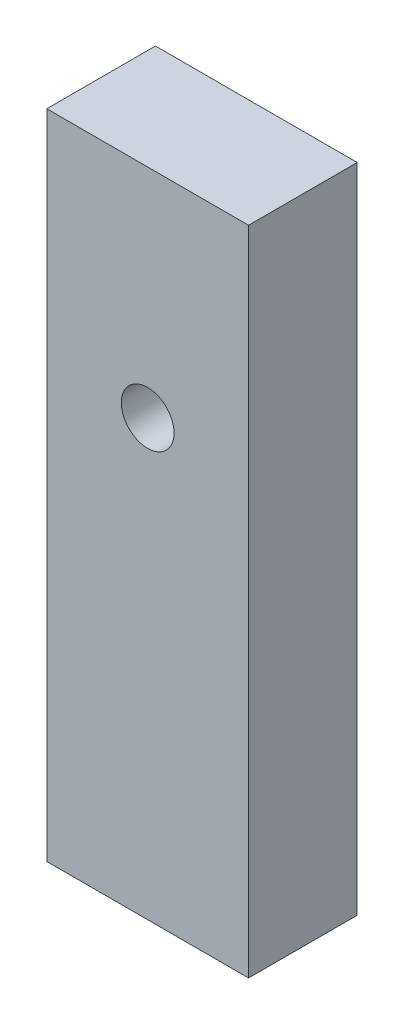
ISO-10303-21;
HEADER;
FILE_DESCRIPTION(('STEP AP214'),'2;1');
FILE_NAME('part.step','',(''),(''),'','','');
FILE_SCHEMA(('AUTOMOTIVE_DESIGN { 1 0 10303 214 1 1 1 1 }'));
ENDSEC;
DATA;
#1=APPLICATION_CONTEXT('core data for automotive mechanical design processes');
#2=APPLICATION_PROTOCOL_DEFINITION('international standard','automotive_design',2000,#1);
#3=PRODUCT_CONTEXT('',#1,'mechanical');
#4=PRODUCT('Part','Part','',(#3));
#5=PRODUCT_RELATED_PRODUCT_CATEGORY('part','',(#4));
#6=PRODUCT_DEFINITION_FORMATION('','',#4);
#7=PRODUCT_DEFINITION_CONTEXT('part definition',#1,'design');
#8=PRODUCT_DEFINITION('design','',#6,#7);
#9=PRODUCT_DEFINITION_SHAPE('','',#8);
#10=(LENGTH_UNIT() NAMED_UNIT(*) SI_UNIT(.MILLI.,.METRE.));
#11=(NAMED_UNIT(*) PLANE_ANGLE_UNIT() SI_UNIT($,.RADIAN.));
#12=(NAMED_UNIT(*) SI_UNIT($,.STERADIAN.) SOLID_ANGLE_UNIT());
#13=UNCERTAINTY_MEASURE_WITH_UNIT(LENGTH_MEASURE(1.E-05),#10,'distance_accuracy_value','');
#14=(GEOMETRIC_REPRESENTATION_CONTEXT(3) GLOBAL_UNCERTAINTY_ASSIGNED_CONTEXT((#13)) GLOBAL_UNIT_ASSIGNED_CONTEXT((#10,
#11,#12)) REPRESENTATION_CONTEXT('',''));
#15=CARTESIAN_POINT('',(0.,0.,0.));
#16=DIRECTION('',(0.,0.,1.));
#17=DIRECTION('',(1.,0.,0.));
#18=AXIS2_PLACEMENT_3D('',#15,#16,#17);
#19=CARTESIAN_POINT('',(-12.6395927036482,56.0780396566423,7.));
#20=DIRECTION('',(-1.,0.,0.));
#21=DIRECTION('',(0.,-1.,0.));
#22=AXIS2_PLACEMENT_3D('',#19,#20,#21);
#23=PLANE('',#22);
#24=DIRECTION('',(0.,1.,0.));
#25=VECTOR('',#24,1.);
#26=CARTESIAN_POINT('',(-12.6395927036482,56.0780396566423,0.));
#27=LINE('',#26,#25);
#28=CARTESIAN_POINT('',(-12.6395927036482,14.0780396566423,0.));
#29=VERTEX_POINT('',#28);
#30=CARTESIAN_POINT('',(-12.6395927036482,56.0780396566423,0.));
#31=VERTEX_POINT('',#30);
#32=EDGE_CURVE('E160',#29,#31,#27,.T.);
#33=ORIENTED_EDGE('',*,*,#32,.T.);
#34=DIRECTION('',(0.,0.,-1.));
#35=VECTOR('',#34,1.);
#36=CARTESIAN_POINT('',(-12.6395927036482,56.0780396566423,7.));
#37=LINE('',#36,#35);
#38=CARTESIAN_POINT('',(-12.6395927036482,56.0780396566423,7.));
#39=VERTEX_POINT('',#38);
#40=EDGE_CURVE('E11',#39,#31,#37,.T.);
#41=ORIENTED_EDGE('',*,*,#40,.F.);
#42=DIRECTION('',(0.,1.,0.));
#43=VECTOR('',#42,1.);
#44=CARTESIAN_POINT('',(-12.6395927036482,56.0780396566423,7.));
#45=LINE('',#44,#43);
#46=CARTESIAN_POINT('',(-12.6395927036482,14.0780396566423,7.));
#47=VERTEX_POINT('',#46);
#48=EDGE_CURVE('E166',#47,#39,#45,.T.);
#49=ORIENTED_EDGE('',*,*,#48,.F.);
#50=DIRECTION('',(0.,0.,-1.));
#51=VECTOR('',#50,1.);
#52=CARTESIAN_POINT('',(-12.6395927036482,14.0780396566423,7.));
#53=LINE('',#52,#51);
#54=EDGE_CURVE('E176',#47,#29,#53,.T.);
#55=ORIENTED_EDGE('',*,*,#54,.T.);
#56=EDGE_LOOP('',(#33,#41,#49,#55));
#57=FACE_BOUND('',#56,.T.);
#58=ADVANCED_FACE('F38',(#57),#23,.F.);
#59=CARTESIAN_POINT('',(-25.6395927036482,56.0780396566423,7.));
#60=DIRECTION('',(0.,-1.,0.));
#61=DIRECTION('',(0.,0.,-1.));
#62=AXIS2_PLACEMENT_3D('',#59,#60,#61);
#63=PLANE('',#62);
#64=DIRECTION('',(-1.,0.,0.));
#65=VECTOR('',#64,1.);
#66=CARTESIAN_POINT('',(-25.6395927036482,56.0780396566423,0.));
#67=LINE('',#66,#65);
#68=CARTESIAN_POINT('',(-25.6395927036482,56.0780396566423,0.));
#69=VERTEX_POINT('',#68);
#70=EDGE_CURVE('E180',#31,#69,#67,.T.);
#71=ORIENTED_EDGE('',*,*,#70,.T.);
#72=DIRECTION('',(0.,0.,-1.));
#73=VECTOR('',#72,1.);
#74=CARTESIAN_POINT('',(-25.6395927036482,56.0780396566423,7.));
#75=LINE('',#74,#73);
#76=CARTESIAN_POINT('',(-25.6395927036482,56.0780396566423,7.));
#77=VERTEX_POINT('',#76);
#78=EDGE_CURVE('E46',#77,#69,#75,.T.);
#79=ORIENTED_EDGE('',*,*,#78,.F.);
#80=DIRECTION('',(-1.,0.,0.));
#81=VECTOR('',#80,1.);
#82=CARTESIAN_POINT('',(-25.6395927036482,56.0780396566423,7.));
#83=LINE('',#82,#81);
#84=EDGE_CURVE('E90',#39,#77,#83,.T.);
#85=ORIENTED_EDGE('',*,*,#84,.F.);
#86=ORIENTED_EDGE('',*,*,#40,.T.);
#87=EDGE_LOOP('',(#71,#79,#85,#86));
#88=FACE_BOUND('',#87,.T.);
#89=ADVANCED_FACE('F216',(#88),#63,.F.);
#90=CARTESIAN_POINT('',(-25.6395927036482,56.0780396566423,7.));
#91=DIRECTION('',(1.,0.,0.));
#92=DIRECTION('',(0.,1.,0.));
#93=AXIS2_PLACEMENT_3D('',#90,#91,#92);
#94=PLANE('',#93);
#95=DIRECTION('',(0.,-1.,0.));
#96=VECTOR('',#95,1.);
#97=CARTESIAN_POINT('',(-25.6395927036482,56.0780396566423,0.));
#98=LINE('',#97,#96);
#99=CARTESIAN_POINT('',(-25.6395927036482,14.0780396566423,0.));
#100=VERTEX_POINT('',#99);
#101=EDGE_CURVE('E183',#69,#100,#98,.T.);
#102=ORIENTED_EDGE('',*,*,#101,.T.);
#103=DIRECTION('',(0.,0.,-1.));
#104=VECTOR('',#103,1.);
#105=CARTESIAN_POINT('',(-25.6395927036482,14.0780396566423,7.));
#106=LINE('',#105,#104);
#107=CARTESIAN_POINT('',(-25.6395927036482,14.0780396566423,7.));
#108=VERTEX_POINT('',#107);
#109=EDGE_CURVE('E190',#108,#100,#106,.T.);
#110=ORIENTED_EDGE('',*,*,#109,.F.);
#111=DIRECTION('',(0.,-1.,0.));
#112=VECTOR('',#111,1.);
#113=CARTESIAN_POINT('',(-25.6395927036482,56.0780396566423,7.));
#114=LINE('',#113,#112);
#115=EDGE_CURVE('E171',#77,#108,#114,.T.);
#116=ORIENTED_EDGE('',*,*,#115,.F.);
#117=ORIENTED_EDGE('',*,*,#78,.T.);
#118=EDGE_LOOP('',(#102,#110,#116,#117));
#119=FACE_BOUND('',#118,.T.);
#120=ADVANCED_FACE('F197',(#119),#94,.F.);
#121=CARTESIAN_POINT('',(-25.6395927036482,14.0780396566423,7.));
#122=DIRECTION('',(0.,1.,0.));
#123=DIRECTION('',(0.,0.,1.));
#124=AXIS2_PLACEMENT_3D('',#121,#122,#123);
#125=PLANE('',#124);
#126=DIRECTION('',(1.,0.,0.));
#127=VECTOR('',#126,1.);
#128=CARTESIAN_POINT('',(-25.6395927036482,14.0780396566423,0.));
#129=LINE('',#128,#127);
#130=EDGE_CURVE('E83',#100,#29,#129,.T.);
#131=ORIENTED_EDGE('',*,*,#130,.T.);
#132=ORIENTED_EDGE('',*,*,#54,.F.);
#133=DIRECTION('',(1.,0.,0.));
#134=VECTOR('',#133,1.);
#135=CARTESIAN_POINT('',(-25.6395927036482,14.0780396566423,7.));
#136=LINE('',#135,#134);
#137=EDGE_CURVE('E62',#108,#47,#136,.T.);
#138=ORIENTED_EDGE('',*,*,#137,.F.);
#139=ORIENTED_EDGE('',*,*,#109,.T.);
#140=EDGE_LOOP('',(#131,#132,#138,#139));
#141=FACE_BOUND('',#140,.T.);
#142=ADVANCED_FACE('F205',(#141),#125,.F.);
#143=CARTESIAN_POINT('',(0.,0.,7.));
#144=DIRECTION('',(0.,0.,1.));
#145=DIRECTION('',(1.,0.,0.));
#146=AXIS2_PLACEMENT_3D('',#143,#144,#145);
#147=PLANE('',#146);
#148=CARTESIAN_POINT('',(-19.1395927036482,42.0780396566423,7.));
#149=DIRECTION('',(0.,0.,1.));
#150=DIRECTION('',(1.,0.,0.));
#151=AXIS2_PLACEMENT_3D('',#148,#149,#150);
#152=CIRCLE('',#151,1.7);
#153=CARTESIAN_POINT('',(-17.4395927036482,42.0780396566423,7.));
#154=VERTEX_POINT('',#153);
#155=EDGE_CURVE('E142',#154,#154,#152,.F.);
#156=ORIENTED_EDGE('',*,*,#155,.T.);
#157=EDGE_LOOP('',(#156));
#158=FACE_BOUND('',#157,.T.);
#159=ORIENTED_EDGE('',*,*,#48,.T.);
#160=ORIENTED_EDGE('',*,*,#84,.T.);
#161=ORIENTED_EDGE('',*,*,#115,.T.);
#162=ORIENTED_EDGE('',*,*,#137,.T.);
#163=EDGE_LOOP('',(#159,#160,#161,#162));
#164=FACE_BOUND('',#163,.T.);
#165=ADVANCED_FACE('F207',(#158,#164),#147,.T.);
#166=CARTESIAN_POINT('',(0.,0.,0.));
#167=DIRECTION('',(0.,0.,1.));
#168=DIRECTION('',(1.,0.,0.));
#169=AXIS2_PLACEMENT_3D('',#166,#167,#168);
#170=PLANE('',#169);
#171=CARTESIAN_POINT('',(-19.1395927036482,42.0780396566423,0.));
#172=DIRECTION('',(0.,0.,1.));
#173=DIRECTION('',(1.,0.,0.));
#174=AXIS2_PLACEMENT_3D('',#171,#172,#173);
#175=CIRCLE('',#174,1.7);
#176=CARTESIAN_POINT('',(-17.4395927036482,42.0780396566423,0.));
#177=VERTEX_POINT('',#176);
#178=EDGE_CURVE('E305',#177,#177,#175,.T.);
#179=ORIENTED_EDGE('',*,*,#178,.T.);
#180=EDGE_LOOP('',(#179));
#181=FACE_BOUND('',#180,.T.);
#182=DIRECTION('',(1.,0.,0.));
#183=VECTOR('',#182,1.);
#184=CARTESIAN_POINT('',(-13.6395927036482,36.8780396566423,0.));
#185=LINE('',#184,#183);
#186=CARTESIAN_POINT('',(-24.6395927036482,36.8780396566423,0.));
#187=VERTEX_POINT('',#186);
#188=CARTESIAN_POINT('',(-13.6395927036482,36.8780396566423,0.));
#189=VERTEX_POINT('',#188);
#190=EDGE_CURVE('E151',#187,#189,#185,.T.);
#191=ORIENTED_EDGE('',*,*,#190,.F.);
#192=DIRECTION('',(0.,1.,0.));
#193=VECTOR('',#192,1.);
#194=CARTESIAN_POINT('',(-24.6395927036482,36.8780396566423,0.));
#195=LINE('',#194,#193);
#196=CARTESIAN_POINT('',(-24.6395927036482,33.2780396566423,0.));
#197=VERTEX_POINT('',#196);
#198=EDGE_CURVE('E53',#197,#187,#195,.T.);
#199=ORIENTED_EDGE('',*,*,#198,.F.);
#200=DIRECTION('',(-1.,0.,0.));
#201=VECTOR('',#200,1.);
#202=CARTESIAN_POINT('',(-13.6395927036482,33.2780396566423,0.));
#203=LINE('',#202,#201);
#204=CARTESIAN_POINT('',(-13.6395927036482,33.2780396566423,0.));
#205=VERTEX_POINT('',#204);
#206=EDGE_CURVE('E135',#205,#197,#203,.T.);
#207=ORIENTED_EDGE('',*,*,#206,.F.);
#208=DIRECTION('',(0.,-1.,0.));
#209=VECTOR('',#208,1.);
#210=CARTESIAN_POINT('',(-13.6395927036482,36.8780396566423,0.));
#211=LINE('',#210,#209);
#212=EDGE_CURVE('E139',#189,#205,#211,.T.);
#213=ORIENTED_EDGE('',*,*,#212,.F.);
#214=EDGE_LOOP('',(#191,#199,#207,#213));
#215=FACE_BOUND('',#214,.T.);
#216=ORIENTED_EDGE('',*,*,#32,.F.);
#217=ORIENTED_EDGE('',*,*,#130,.F.);
#218=ORIENTED_EDGE('',*,*,#101,.F.);
#219=ORIENTED_EDGE('',*,*,#70,.F.);
#220=EDGE_LOOP('',(#216,#217,#218,#219));
#221=FACE_BOUND('',#220,.T.);
#222=ADVANCED_FACE('F201',(#181,#215,#221),#170,.F.);
#223=CARTESIAN_POINT('',(-24.6395927036482,36.8780396566423,4.));
#224=DIRECTION('',(-1.,0.,0.));
#225=DIRECTION('',(0.,0.,1.));
#226=AXIS2_PLACEMENT_3D('',#223,#224,#225);
#227=PLANE('',#226);
#228=ORIENTED_EDGE('',*,*,#198,.T.);
#229=DIRECTION('',(0.,0.,-1.));
#230=VECTOR('',#229,1.);
#231=CARTESIAN_POINT('',(-24.6395927036482,36.8780396566423,4.));
#232=LINE('',#231,#230);
#233=CARTESIAN_POINT('',(-24.6395927036482,36.8780396566423,4.));
#234=VERTEX_POINT('',#233);
#235=EDGE_CURVE('E110',#234,#187,#232,.T.);
#236=ORIENTED_EDGE('',*,*,#235,.F.);
#237=DIRECTION('',(0.,1.,0.));
#238=VECTOR('',#237,1.);
#239=CARTESIAN_POINT('',(-24.6395927036482,36.8780396566423,4.));
#240=LINE('',#239,#238);
#241=CARTESIAN_POINT('',(-24.6395927036482,33.2780396566423,4.));
#242=VERTEX_POINT('',#241);
#243=EDGE_CURVE('E114',#242,#234,#240,.T.);
#244=ORIENTED_EDGE('',*,*,#243,.F.);
#245=DIRECTION('',(0.,0.,-1.));
#246=VECTOR('',#245,1.);
#247=CARTESIAN_POINT('',(-24.6395927036482,33.2780396566423,4.));
#248=LINE('',#247,#246);
#249=EDGE_CURVE('E157',#242,#197,#248,.T.);
#250=ORIENTED_EDGE('',*,*,#249,.T.);
#251=EDGE_LOOP('',(#228,#236,#244,#250));
#252=FACE_BOUND('',#251,.T.);
#253=ADVANCED_FACE('F112',(#252),#227,.F.);
#254=CARTESIAN_POINT('',(-13.6395927036482,33.2780396566423,4.));
#255=DIRECTION('',(0.,-1.,0.));
#256=DIRECTION('',(0.,0.,-1.));
#257=AXIS2_PLACEMENT_3D('',#254,#255,#256);
#258=PLANE('',#257);
#259=ORIENTED_EDGE('',*,*,#206,.T.);
#260=ORIENTED_EDGE('',*,*,#249,.F.);
#261=DIRECTION('',(-1.,0.,0.));
#262=VECTOR('',#261,1.);
#263=CARTESIAN_POINT('',(-13.6395927036482,33.2780396566423,4.));
#264=LINE('',#263,#262);
#265=CARTESIAN_POINT('',(-13.6395927036482,33.2780396566423,4.));
#266=VERTEX_POINT('',#265);
#267=EDGE_CURVE('E121',#266,#242,#264,.T.);
#268=ORIENTED_EDGE('',*,*,#267,.F.);
#269=DIRECTION('',(0.,0.,-1.));
#270=VECTOR('',#269,1.);
#271=CARTESIAN_POINT('',(-13.6395927036482,33.2780396566423,4.));
#272=LINE('',#271,#270);
#273=EDGE_CURVE('E161',#266,#205,#272,.T.);
#274=ORIENTED_EDGE('',*,*,#273,.T.);
#275=EDGE_LOOP('',(#259,#260,#268,#274));
#276=FACE_BOUND('',#275,.T.);
#277=ADVANCED_FACE('F243',(#276),#258,.F.);
#278=CARTESIAN_POINT('',(-13.6395927036482,36.8780396566423,4.));
#279=DIRECTION('',(1.,0.,0.));
#280=DIRECTION('',(0.,0.,-1.));
#281=AXIS2_PLACEMENT_3D('',#278,#279,#280);
#282=PLANE('',#281);
#283=ORIENTED_EDGE('',*,*,#212,.T.);
#284=ORIENTED_EDGE('',*,*,#273,.F.);
#285=DIRECTION('',(0.,-1.,0.));
#286=VECTOR('',#285,1.);
#287=CARTESIAN_POINT('',(-13.6395927036482,36.8780396566423,4.));
#288=LINE('',#287,#286);
#289=CARTESIAN_POINT('',(-13.6395927036482,36.8780396566423,4.));
#290=VERTEX_POINT('',#289);
#291=EDGE_CURVE('E130',#290,#266,#288,.T.);
#292=ORIENTED_EDGE('',*,*,#291,.F.);
#293=DIRECTION('',(0.,0.,-1.));
#294=VECTOR('',#293,1.);
#295=CARTESIAN_POINT('',(-13.6395927036482,36.8780396566423,4.));
#296=LINE('',#295,#294);
#297=EDGE_CURVE('E120',#290,#189,#296,.T.);
#298=ORIENTED_EDGE('',*,*,#297,.T.);
#299=EDGE_LOOP('',(#283,#284,#292,#298));
#300=FACE_BOUND('',#299,.T.);
#301=ADVANCED_FACE('F254',(#300),#282,.F.);
#302=CARTESIAN_POINT('',(-13.6395927036482,36.8780396566423,4.));
#303=DIRECTION('',(0.,1.,0.));
#304=DIRECTION('',(0.,0.,1.));
#305=AXIS2_PLACEMENT_3D('',#302,#303,#304);
#306=PLANE('',#305);
#307=ORIENTED_EDGE('',*,*,#190,.T.);
#308=ORIENTED_EDGE('',*,*,#297,.F.);
#309=DIRECTION('',(1.,0.,0.));
#310=VECTOR('',#309,1.);
#311=CARTESIAN_POINT('',(-13.6395927036482,36.8780396566423,4.));
#312=LINE('',#311,#310);
#313=EDGE_CURVE('E124',#234,#290,#312,.T.);
#314=ORIENTED_EDGE('',*,*,#313,.F.);
#315=ORIENTED_EDGE('',*,*,#235,.T.);
#316=EDGE_LOOP('',(#307,#308,#314,#315));
#317=FACE_BOUND('',#316,.T.);
#318=ADVANCED_FACE('F125',(#317),#306,.F.);
#319=CARTESIAN_POINT('',(0.,0.,4.));
#320=DIRECTION('',(0.,0.,-1.));
#321=DIRECTION('',(-1.,0.,0.));
#322=AXIS2_PLACEMENT_3D('',#319,#320,#321);
#323=PLANE('',#322);
#324=ORIENTED_EDGE('',*,*,#243,.T.);
#325=ORIENTED_EDGE('',*,*,#313,.T.);
#326=ORIENTED_EDGE('',*,*,#291,.T.);
#327=ORIENTED_EDGE('',*,*,#267,.T.);
#328=EDGE_LOOP('',(#324,#325,#326,#327));
#329=FACE_BOUND('',#328,.T.);
#330=ADVANCED_FACE('F132',(#329),#323,.T.);
#331=CARTESIAN_POINT('',(-19.1395927036482,42.0780396566423,10.));
#332=DIRECTION('',(0.,0.,-1.));
#333=DIRECTION('',(-1.,0.,0.));
#334=AXIS2_PLACEMENT_3D('',#331,#332,#333);
#335=CYLINDRICAL_SURFACE('',#334,1.7);
#336=ORIENTED_EDGE('',*,*,#155,.F.);
#337=EDGE_LOOP('',(#336));
#338=FACE_BOUND('',#337,.T.);
#339=ORIENTED_EDGE('',*,*,#178,.F.);
#340=EDGE_LOOP('',(#339));
#341=FACE_BOUND('',#340,.T.);
#342=ADVANCED_FACE('F280',(#338,#341),#335,.F.);
#343=CLOSED_SHELL('',(#58,#89,#120,#142,#165,#222,#253,#277,#301,#318,#330,#342));
#344=MANIFOLD_SOLID_BREP('B2',#343);
#345=ADVANCED_BREP_SHAPE_REPRESENTATION('',(#18,#344),#14);
#346=SHAPE_DEFINITION_REPRESENTATION(#9,#345);
ENDSEC;
END-ISO-10303-21;
